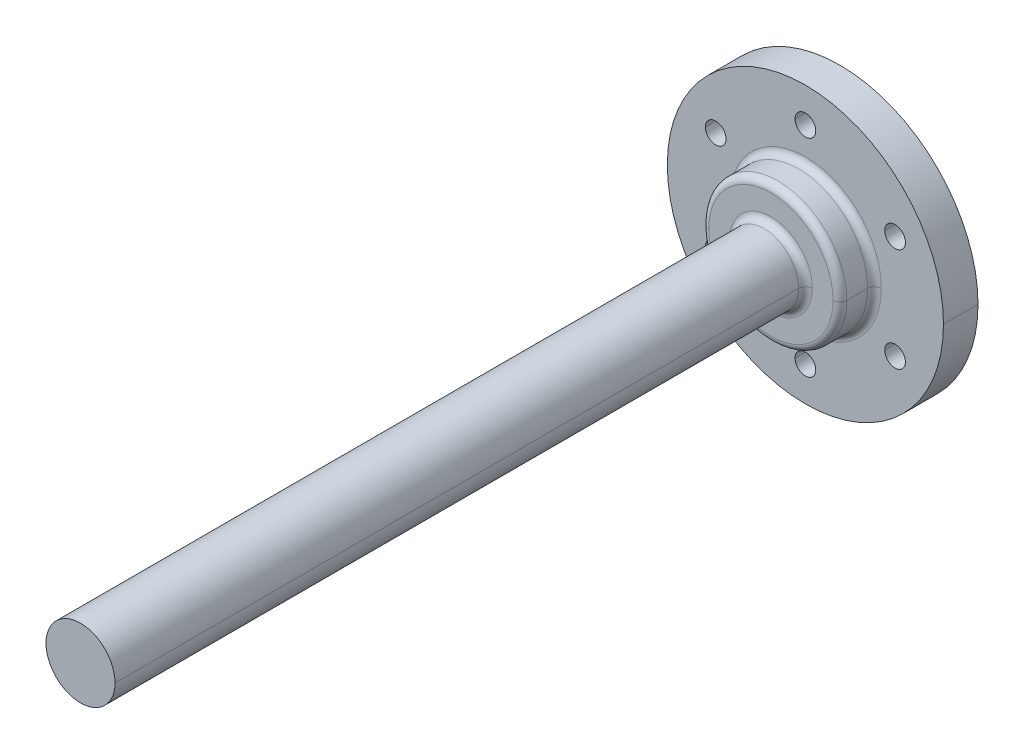
ISO-10303-21;
HEADER;
FILE_DESCRIPTION(('STEP AP214'),'2;1');
FILE_NAME('part.step','',(''),(''),'','','');
FILE_SCHEMA(('AUTOMOTIVE_DESIGN { 1 0 10303 214 1 1 1 1 }'));
ENDSEC;
DATA;
#1=APPLICATION_CONTEXT('core data for automotive mechanical design processes');
#2=APPLICATION_PROTOCOL_DEFINITION('international standard','automotive_design',2000,#1);
#3=PRODUCT_CONTEXT('',#1,'mechanical');
#4=PRODUCT('Part','Part','',(#3));
#5=PRODUCT_RELATED_PRODUCT_CATEGORY('part','',(#4));
#6=PRODUCT_DEFINITION_FORMATION('','',#4);
#7=PRODUCT_DEFINITION_CONTEXT('part definition',#1,'design');
#8=PRODUCT_DEFINITION('design','',#6,#7);
#9=PRODUCT_DEFINITION_SHAPE('','',#8);
#10=(LENGTH_UNIT() NAMED_UNIT(*) SI_UNIT(.MILLI.,.METRE.));
#11=(NAMED_UNIT(*) PLANE_ANGLE_UNIT() SI_UNIT($,.RADIAN.));
#12=(NAMED_UNIT(*) SI_UNIT($,.STERADIAN.) SOLID_ANGLE_UNIT());
#13=UNCERTAINTY_MEASURE_WITH_UNIT(LENGTH_MEASURE(1.E-05),#10,'distance_accuracy_value','');
#14=(GEOMETRIC_REPRESENTATION_CONTEXT(3) GLOBAL_UNCERTAINTY_ASSIGNED_CONTEXT((#13)) GLOBAL_UNIT_ASSIGNED_CONTEXT((#10,
#11,#12)) REPRESENTATION_CONTEXT('',''));
#15=CARTESIAN_POINT('',(0.,0.,0.));
#16=DIRECTION('',(0.,0.,1.));
#17=DIRECTION('',(1.,0.,0.));
#18=AXIS2_PLACEMENT_3D('',#15,#16,#17);
#19=CARTESIAN_POINT('',(0.,0.,11.));
#20=DIRECTION('',(0.,0.,1.));
#21=DIRECTION('',(1.,0.,0.));
#22=AXIS2_PLACEMENT_3D('',#19,#20,#21);
#23=TOROIDAL_SURFACE('',#22,6.,1.);
#24=CARTESIAN_POINT('',(-6.,0.,11.));
#25=DIRECTION('',(0.,1.,0.));
#26=DIRECTION('',(-1.,0.,0.));
#27=AXIS2_PLACEMENT_3D('',#24,#25,#26);
#28=CIRCLE('',#27,1.);
#29=CARTESIAN_POINT('',(-5.,0.,11.));
#30=VERTEX_POINT('',#29);
#31=CARTESIAN_POINT('',(-6.,0.,10.));
#32=VERTEX_POINT('',#31);
#33=EDGE_CURVE('E391',#30,#32,#28,.T.);
#34=ORIENTED_EDGE('',*,*,#33,.F.);
#35=CARTESIAN_POINT('',(0.,0.,11.));
#36=DIRECTION('',(0.,0.,1.));
#37=DIRECTION('',(1.,0.,0.));
#38=AXIS2_PLACEMENT_3D('',#35,#36,#37);
#39=CIRCLE('',#38,5.);
#40=CARTESIAN_POINT('',(5.,0.,11.));
#41=VERTEX_POINT('',#40);
#42=EDGE_CURVE('E269',#41,#30,#39,.T.);
#43=ORIENTED_EDGE('',*,*,#42,.F.);
#44=CARTESIAN_POINT('',(6.,0.,11.));
#45=DIRECTION('',(0.,-1.,0.));
#46=DIRECTION('',(0.,0.,-1.));
#47=AXIS2_PLACEMENT_3D('',#44,#45,#46);
#48=CIRCLE('',#47,1.);
#49=CARTESIAN_POINT('',(6.,0.,10.));
#50=VERTEX_POINT('',#49);
#51=EDGE_CURVE('E189',#41,#50,#48,.T.);
#52=ORIENTED_EDGE('',*,*,#51,.T.);
#53=CARTESIAN_POINT('',(0.,0.,10.));
#54=DIRECTION('',(0.,0.,-1.));
#55=DIRECTION('',(1.,0.,0.));
#56=AXIS2_PLACEMENT_3D('',#53,#54,#55);
#57=CIRCLE('',#56,6.);
#58=EDGE_CURVE('E28',#32,#50,#57,.T.);
#59=ORIENTED_EDGE('',*,*,#58,.F.);
#60=EDGE_LOOP('',(#34,#43,#52,#59));
#61=FACE_BOUND('',#60,.T.);
#62=ADVANCED_FACE('F17',(#61),#23,.F.);
#63=CARTESIAN_POINT('',(0.,0.,9.));
#64=DIRECTION('',(0.,0.,1.));
#65=DIRECTION('',(1.,0.,0.));
#66=AXIS2_PLACEMENT_3D('',#63,#64,#65);
#67=TOROIDAL_SURFACE('',#66,9.,1.);
#68=CARTESIAN_POINT('',(-9.,0.,9.));
#69=DIRECTION('',(0.,1.,0.));
#70=DIRECTION('',(-1.,0.,0.));
#71=AXIS2_PLACEMENT_3D('',#68,#69,#70);
#72=CIRCLE('',#71,1.);
#73=CARTESIAN_POINT('',(-10.,0.,9.));
#74=VERTEX_POINT('',#73);
#75=CARTESIAN_POINT('',(-9.,0.,10.));
#76=VERTEX_POINT('',#75);
#77=EDGE_CURVE('E255',#74,#76,#72,.T.);
#78=ORIENTED_EDGE('',*,*,#77,.F.);
#79=CARTESIAN_POINT('',(0.,0.,9.));
#80=DIRECTION('',(0.,0.,-1.));
#81=DIRECTION('',(1.,0.,0.));
#82=AXIS2_PLACEMENT_3D('',#79,#80,#81);
#83=CIRCLE('',#82,10.);
#84=CARTESIAN_POINT('',(10.,0.,9.));
#85=VERTEX_POINT('',#84);
#86=EDGE_CURVE('E290',#85,#74,#83,.T.);
#87=ORIENTED_EDGE('',*,*,#86,.F.);
#88=CARTESIAN_POINT('',(9.,0.,9.));
#89=DIRECTION('',(0.,-1.,0.));
#90=DIRECTION('',(0.,0.,-1.));
#91=AXIS2_PLACEMENT_3D('',#88,#89,#90);
#92=CIRCLE('',#91,1.);
#93=CARTESIAN_POINT('',(9.,0.,10.));
#94=VERTEX_POINT('',#93);
#95=EDGE_CURVE('E188',#85,#94,#92,.T.);
#96=ORIENTED_EDGE('',*,*,#95,.T.);
#97=CARTESIAN_POINT('',(0.,0.,10.));
#98=DIRECTION('',(0.,0.,1.));
#99=DIRECTION('',(1.,0.,0.));
#100=AXIS2_PLACEMENT_3D('',#97,#98,#99);
#101=CIRCLE('',#100,9.);
#102=EDGE_CURVE('E315',#76,#94,#101,.T.);
#103=ORIENTED_EDGE('',*,*,#102,.F.);
#104=EDGE_LOOP('',(#78,#87,#96,#103));
#105=FACE_BOUND('',#104,.T.);
#106=ADVANCED_FACE('F581',(#105),#67,.T.);
#107=CARTESIAN_POINT('',(0.,0.,6.));
#108=DIRECTION('',(0.,0.,1.));
#109=DIRECTION('',(1.,0.,0.));
#110=AXIS2_PLACEMENT_3D('',#107,#108,#109);
#111=TOROIDAL_SURFACE('',#110,11.,1.);
#112=CARTESIAN_POINT('',(-11.,0.,6.));
#113=DIRECTION('',(0.,1.,0.));
#114=DIRECTION('',(-1.,0.,0.));
#115=AXIS2_PLACEMENT_3D('',#112,#113,#114);
#116=CIRCLE('',#115,1.);
#117=CARTESIAN_POINT('',(-10.,0.,6.));
#118=VERTEX_POINT('',#117);
#119=CARTESIAN_POINT('',(-11.,0.,5.));
#120=VERTEX_POINT('',#119);
#121=EDGE_CURVE('E187',#118,#120,#116,.T.);
#122=ORIENTED_EDGE('',*,*,#121,.F.);
#123=CARTESIAN_POINT('',(0.,0.,6.));
#124=DIRECTION('',(0.,0.,1.));
#125=DIRECTION('',(1.,0.,0.));
#126=AXIS2_PLACEMENT_3D('',#123,#124,#125);
#127=CIRCLE('',#126,10.);
#128=CARTESIAN_POINT('',(10.,0.,6.));
#129=VERTEX_POINT('',#128);
#130=EDGE_CURVE('E352',#129,#118,#127,.T.);
#131=ORIENTED_EDGE('',*,*,#130,.F.);
#132=CARTESIAN_POINT('',(11.,0.,6.));
#133=DIRECTION('',(0.,-1.,0.));
#134=DIRECTION('',(0.,0.,-1.));
#135=AXIS2_PLACEMENT_3D('',#132,#133,#134);
#136=CIRCLE('',#135,1.);
#137=CARTESIAN_POINT('',(11.,0.,5.));
#138=VERTEX_POINT('',#137);
#139=EDGE_CURVE('E323',#129,#138,#136,.T.);
#140=ORIENTED_EDGE('',*,*,#139,.T.);
#141=CARTESIAN_POINT('',(0.,0.,5.));
#142=DIRECTION('',(0.,0.,-1.));
#143=DIRECTION('',(1.,0.,0.));
#144=AXIS2_PLACEMENT_3D('',#141,#142,#143);
#145=CIRCLE('',#144,11.);
#146=EDGE_CURVE('E210',#120,#138,#145,.T.);
#147=ORIENTED_EDGE('',*,*,#146,.F.);
#148=EDGE_LOOP('',(#122,#131,#140,#147));
#149=FACE_BOUND('',#148,.T.);
#150=ADVANCED_FACE('F587',(#149),#111,.F.);
#151=CARTESIAN_POINT('',(0.,0.,-4.));
#152=DIRECTION('',(0.,0.,1.));
#153=DIRECTION('',(1.,0.,0.));
#154=AXIS2_PLACEMENT_3D('',#151,#152,#153);
#155=TOROIDAL_SURFACE('',#154,4.,1.);
#156=CARTESIAN_POINT('',(-4.,0.,-4.));
#157=DIRECTION('',(0.,1.,0.));
#158=DIRECTION('',(-1.,0.,0.));
#159=AXIS2_PLACEMENT_3D('',#156,#157,#158);
#160=CIRCLE('',#159,1.);
#161=CARTESIAN_POINT('',(-4.,0.,-5.));
#162=VERTEX_POINT('',#161);
#163=CARTESIAN_POINT('',(-5.,0.,-4.));
#164=VERTEX_POINT('',#163);
#165=EDGE_CURVE('E199',#162,#164,#160,.T.);
#166=ORIENTED_EDGE('',*,*,#165,.F.);
#167=CARTESIAN_POINT('',(0.,0.,-5.));
#168=DIRECTION('',(0.,0.,-1.));
#169=DIRECTION('',(1.,0.,0.));
#170=AXIS2_PLACEMENT_3D('',#167,#168,#169);
#171=CIRCLE('',#170,4.);
#172=CARTESIAN_POINT('',(4.,0.,-5.));
#173=VERTEX_POINT('',#172);
#174=EDGE_CURVE('E209',#173,#162,#171,.T.);
#175=ORIENTED_EDGE('',*,*,#174,.F.);
#176=CARTESIAN_POINT('',(4.,0.,-4.));
#177=DIRECTION('',(0.,-1.,0.));
#178=DIRECTION('',(0.,0.,-1.));
#179=AXIS2_PLACEMENT_3D('',#176,#177,#178);
#180=CIRCLE('',#179,1.);
#181=CARTESIAN_POINT('',(5.,0.,-4.));
#182=VERTEX_POINT('',#181);
#183=EDGE_CURVE('E214',#173,#182,#180,.T.);
#184=ORIENTED_EDGE('',*,*,#183,.T.);
#185=CARTESIAN_POINT('',(0.,0.,-4.));
#186=DIRECTION('',(0.,0.,1.));
#187=DIRECTION('',(1.,0.,0.));
#188=AXIS2_PLACEMENT_3D('',#185,#186,#187);
#189=CIRCLE('',#188,5.);
#190=EDGE_CURVE('E205',#164,#182,#189,.T.);
#191=ORIENTED_EDGE('',*,*,#190,.F.);
#192=EDGE_LOOP('',(#166,#175,#184,#191));
#193=FACE_BOUND('',#192,.T.);
#194=ADVANCED_FACE('F635',(#193),#155,.T.);
#195=CARTESIAN_POINT('',(0.,0.,110.));
#196=DIRECTION('',(0.,0.,-1.));
#197=DIRECTION('',(-1.,0.,0.));
#198=AXIS2_PLACEMENT_3D('',#195,#196,#197);
#199=CYLINDRICAL_SURFACE('',#198,5.);
#200=DIRECTION('',(0.,0.,-1.));
#201=VECTOR('',#200,1.);
#202=CARTESIAN_POINT('',(5.,0.,110.));
#203=LINE('',#202,#201);
#204=CARTESIAN_POINT('',(5.,0.,110.));
#205=VERTEX_POINT('',#204);
#206=EDGE_CURVE('E348',#205,#41,#203,.T.);
#207=ORIENTED_EDGE('',*,*,#206,.F.);
#208=CARTESIAN_POINT('',(0.,0.,110.));
#209=DIRECTION('',(0.,0.,1.));
#210=DIRECTION('',(1.,0.,0.));
#211=AXIS2_PLACEMENT_3D('',#208,#209,#210);
#212=CIRCLE('',#211,5.);
#213=CARTESIAN_POINT('',(-5.,0.,110.));
#214=VERTEX_POINT('',#213);
#215=EDGE_CURVE('E11',#214,#205,#212,.T.);
#216=ORIENTED_EDGE('',*,*,#215,.F.);
#217=DIRECTION('',(0.,0.,-1.));
#218=VECTOR('',#217,1.);
#219=CARTESIAN_POINT('',(-5.,0.,110.));
#220=LINE('',#219,#218);
#221=EDGE_CURVE('E264',#214,#30,#220,.T.);
#222=ORIENTED_EDGE('',*,*,#221,.T.);
#223=CARTESIAN_POINT('',(0.,0.,11.));
#224=DIRECTION('',(0.,0.,1.));
#225=DIRECTION('',(1.,0.,0.));
#226=AXIS2_PLACEMENT_3D('',#223,#224,#225);
#227=CIRCLE('',#226,5.);
#228=EDGE_CURVE('E407',#30,#41,#227,.T.);
#229=ORIENTED_EDGE('',*,*,#228,.T.);
#230=EDGE_LOOP('',(#207,#216,#222,#229));
#231=FACE_BOUND('',#230,.T.);
#232=ADVANCED_FACE('F653',(#231),#199,.T.);
#233=CARTESIAN_POINT('',(0.,0.,110.));
#234=DIRECTION('',(0.,0.,1.));
#235=DIRECTION('',(1.,0.,0.));
#236=AXIS2_PLACEMENT_3D('',#233,#234,#235);
#237=PLANE('',#236);
#238=ORIENTED_EDGE('',*,*,#215,.T.);
#239=CARTESIAN_POINT('',(0.,0.,110.));
#240=DIRECTION('',(0.,0.,1.));
#241=DIRECTION('',(1.,0.,0.));
#242=AXIS2_PLACEMENT_3D('',#239,#240,#241);
#243=CIRCLE('',#242,5.);
#244=EDGE_CURVE('E378',#205,#214,#243,.T.);
#245=ORIENTED_EDGE('',*,*,#244,.T.);
#246=EDGE_LOOP('',(#238,#245));
#247=FACE_BOUND('',#246,.T.);
#248=ADVANCED_FACE('F660',(#247),#237,.T.);
#249=CARTESIAN_POINT('',(0.,0.,10.));
#250=DIRECTION('',(0.,0.,1.));
#251=DIRECTION('',(1.,0.,0.));
#252=AXIS2_PLACEMENT_3D('',#249,#250,#251);
#253=PLANE('',#252);
#254=CARTESIAN_POINT('',(0.,0.,10.));
#255=DIRECTION('',(0.,0.,-1.));
#256=DIRECTION('',(1.,0.,0.));
#257=AXIS2_PLACEMENT_3D('',#254,#255,#256);
#258=CIRCLE('',#257,6.);
#259=EDGE_CURVE('E194',#50,#32,#258,.T.);
#260=ORIENTED_EDGE('',*,*,#259,.T.);
#261=ORIENTED_EDGE('',*,*,#58,.T.);
#262=EDGE_LOOP('',(#260,#261));
#263=FACE_BOUND('',#262,.T.);
#264=CARTESIAN_POINT('',(0.,0.,10.));
#265=DIRECTION('',(0.,0.,1.));
#266=DIRECTION('',(1.,0.,0.));
#267=AXIS2_PLACEMENT_3D('',#264,#265,#266);
#268=CIRCLE('',#267,9.);
#269=EDGE_CURVE('E319',#94,#76,#268,.T.);
#270=ORIENTED_EDGE('',*,*,#269,.T.);
#271=ORIENTED_EDGE('',*,*,#102,.T.);
#272=EDGE_LOOP('',(#270,#271));
#273=FACE_BOUND('',#272,.T.);
#274=ADVANCED_FACE('F592',(#263,#273),#253,.T.);
#275=CARTESIAN_POINT('',(0.,0.,10.));
#276=DIRECTION('',(0.,0.,-1.));
#277=DIRECTION('',(-1.,0.,0.));
#278=AXIS2_PLACEMENT_3D('',#275,#276,#277);
#279=CYLINDRICAL_SURFACE('',#278,10.);
#280=DIRECTION('',(0.,0.,-1.));
#281=VECTOR('',#280,1.);
#282=CARTESIAN_POINT('',(10.,0.,10.));
#283=LINE('',#282,#281);
#284=EDGE_CURVE('E268',#85,#129,#283,.T.);
#285=ORIENTED_EDGE('',*,*,#284,.F.);
#286=ORIENTED_EDGE('',*,*,#86,.T.);
#287=DIRECTION('',(0.,0.,-1.));
#288=VECTOR('',#287,1.);
#289=CARTESIAN_POINT('',(-10.,0.,10.));
#290=LINE('',#289,#288);
#291=EDGE_CURVE('E244',#74,#118,#290,.T.);
#292=ORIENTED_EDGE('',*,*,#291,.T.);
#293=CARTESIAN_POINT('',(0.,0.,6.));
#294=DIRECTION('',(0.,0.,1.));
#295=DIRECTION('',(1.,0.,0.));
#296=AXIS2_PLACEMENT_3D('',#293,#294,#295);
#297=CIRCLE('',#296,10.);
#298=EDGE_CURVE('E183',#118,#129,#297,.T.);
#299=ORIENTED_EDGE('',*,*,#298,.T.);
#300=EDGE_LOOP('',(#285,#286,#292,#299));
#301=FACE_BOUND('',#300,.T.);
#302=ADVANCED_FACE('F637',(#301),#279,.T.);
#303=CARTESIAN_POINT('',(0.,0.,-5.));
#304=DIRECTION('',(0.,0.,1.));
#305=DIRECTION('',(1.,0.,0.));
#306=AXIS2_PLACEMENT_3D('',#303,#304,#305);
#307=PLANE('',#306);
#308=ORIENTED_EDGE('',*,*,#174,.T.);
#309=CARTESIAN_POINT('',(0.,0.,-5.));
#310=DIRECTION('',(0.,0.,-1.));
#311=DIRECTION('',(1.,0.,0.));
#312=AXIS2_PLACEMENT_3D('',#309,#310,#311);
#313=CIRCLE('',#312,4.);
#314=EDGE_CURVE('E204',#162,#173,#313,.T.);
#315=ORIENTED_EDGE('',*,*,#314,.T.);
#316=EDGE_LOOP('',(#308,#315));
#317=FACE_BOUND('',#316,.T.);
#318=ADVANCED_FACE('F575',(#317),#307,.F.);
#319=CARTESIAN_POINT('',(0.,0.,110.));
#320=DIRECTION('',(0.,0.,-1.));
#321=DIRECTION('',(-1.,0.,0.));
#322=AXIS2_PLACEMENT_3D('',#319,#320,#321);
#323=CYLINDRICAL_SURFACE('',#322,5.);
#324=DIRECTION('',(0.,0.,-1.));
#325=VECTOR('',#324,1.);
#326=CARTESIAN_POINT('',(5.,0.,110.));
#327=LINE('',#326,#325);
#328=CARTESIAN_POINT('',(5.,0.,0.));
#329=VERTEX_POINT('',#328);
#330=EDGE_CURVE('E270',#329,#182,#327,.T.);
#331=ORIENTED_EDGE('',*,*,#330,.F.);
#332=CARTESIAN_POINT('',(0.,0.,0.));
#333=DIRECTION('',(0.,0.,-1.));
#334=DIRECTION('',(1.,0.,0.));
#335=AXIS2_PLACEMENT_3D('',#332,#333,#334);
#336=CIRCLE('',#335,5.);
#337=CARTESIAN_POINT('',(-5.,0.,0.));
#338=VERTEX_POINT('',#337);
#339=EDGE_CURVE('E260',#329,#338,#336,.T.);
#340=ORIENTED_EDGE('',*,*,#339,.T.);
#341=DIRECTION('',(0.,0.,-1.));
#342=VECTOR('',#341,1.);
#343=CARTESIAN_POINT('',(-5.,0.,110.));
#344=LINE('',#343,#342);
#345=EDGE_CURVE('E274',#338,#164,#344,.T.);
#346=ORIENTED_EDGE('',*,*,#345,.T.);
#347=ORIENTED_EDGE('',*,*,#190,.T.);
#348=EDGE_LOOP('',(#331,#340,#346,#347));
#349=FACE_BOUND('',#348,.T.);
#350=ADVANCED_FACE('F568',(#349),#323,.T.);
#351=CARTESIAN_POINT('',(0.,0.,5.));
#352=DIRECTION('',(0.,0.,1.));
#353=DIRECTION('',(1.,0.,0.));
#354=AXIS2_PLACEMENT_3D('',#351,#352,#353);
#355=PLANE('',#354);
#356=CARTESIAN_POINT('',(0.,15.,5.));
#357=DIRECTION('',(0.,0.,1.));
#358=DIRECTION('',(1.,0.,0.));
#359=AXIS2_PLACEMENT_3D('',#356,#357,#358);
#360=CIRCLE('',#359,1.5);
#361=CARTESIAN_POINT('',(-1.5,15.,5.));
#362=VERTEX_POINT('',#361);
#363=CARTESIAN_POINT('',(1.5,15.,5.));
#364=VERTEX_POINT('',#363);
#365=EDGE_CURVE('E142',#362,#364,#360,.T.);
#366=ORIENTED_EDGE('',*,*,#365,.F.);
#367=CARTESIAN_POINT('',(0.,15.,5.));
#368=DIRECTION('',(0.,0.,1.));
#369=DIRECTION('',(1.,0.,0.));
#370=AXIS2_PLACEMENT_3D('',#367,#368,#369);
#371=CIRCLE('',#370,1.5);
#372=EDGE_CURVE('E137',#364,#362,#371,.T.);
#373=ORIENTED_EDGE('',*,*,#372,.F.);
#374=EDGE_LOOP('',(#366,#373));
#375=FACE_BOUND('',#374,.T.);
#376=CARTESIAN_POINT('',(12.9903810567669,7.50000000000056,5.));
#377=DIRECTION('',(0.,0.,1.));
#378=DIRECTION('',(1.,0.,0.));
#379=AXIS2_PLACEMENT_3D('',#376,#377,#378);
#380=CIRCLE('',#379,1.50000000000018);
#381=CARTESIAN_POINT('',(11.4903810567667,7.50000000000056,5.));
#382=VERTEX_POINT('',#381);
#383=CARTESIAN_POINT('',(14.4903810567671,7.50000000000056,5.));
#384=VERTEX_POINT('',#383);
#385=EDGE_CURVE('E311',#382,#384,#380,.T.);
#386=ORIENTED_EDGE('',*,*,#385,.F.);
#387=CARTESIAN_POINT('',(12.9903810567669,7.50000000000056,5.));
#388=DIRECTION('',(0.,0.,1.));
#389=DIRECTION('',(1.,0.,0.));
#390=AXIS2_PLACEMENT_3D('',#387,#388,#389);
#391=CIRCLE('',#390,1.50000000000018);
#392=EDGE_CURVE('E179',#384,#382,#391,.T.);
#393=ORIENTED_EDGE('',*,*,#392,.F.);
#394=EDGE_LOOP('',(#386,#393));
#395=FACE_BOUND('',#394,.T.);
#396=CARTESIAN_POINT('',(12.9903810567675,-7.49999999999945,5.));
#397=DIRECTION('',(0.,0.,1.));
#398=DIRECTION('',(1.,0.,0.));
#399=AXIS2_PLACEMENT_3D('',#396,#397,#398);
#400=CIRCLE('',#399,1.50000000000083);
#401=CARTESIAN_POINT('',(11.4903810567667,-7.49999999999945,5.));
#402=VERTEX_POINT('',#401);
#403=CARTESIAN_POINT('',(14.4903810567684,-7.49999999999945,5.));
#404=VERTEX_POINT('',#403);
#405=EDGE_CURVE('E287',#402,#404,#400,.T.);
#406=ORIENTED_EDGE('',*,*,#405,.F.);
#407=CARTESIAN_POINT('',(12.9903810567675,-7.49999999999945,5.));
#408=DIRECTION('',(0.,0.,1.));
#409=DIRECTION('',(1.,0.,0.));
#410=AXIS2_PLACEMENT_3D('',#407,#408,#409);
#411=CIRCLE('',#410,1.50000000000083);
#412=EDGE_CURVE('E178',#404,#402,#411,.T.);
#413=ORIENTED_EDGE('',*,*,#412,.F.);
#414=EDGE_LOOP('',(#406,#413));
#415=FACE_BOUND('',#414,.T.);
#416=CARTESIAN_POINT('',(1.27346601377202E-12,-15.,5.));
#417=DIRECTION('',(0.,0.,1.));
#418=DIRECTION('',(1.,0.,0.));
#419=AXIS2_PLACEMENT_3D('',#416,#417,#418);
#420=CIRCLE('',#419,1.50000000000132);
#421=CARTESIAN_POINT('',(-1.50000000000005,-15.,5.));
#422=VERTEX_POINT('',#421);
#423=CARTESIAN_POINT('',(1.50000000000259,-15.,5.));
#424=VERTEX_POINT('',#423);
#425=EDGE_CURVE('E281',#422,#424,#420,.T.);
#426=ORIENTED_EDGE('',*,*,#425,.F.);
#427=CARTESIAN_POINT('',(1.27346601377202E-12,-15.,5.));
#428=DIRECTION('',(0.,0.,1.));
#429=DIRECTION('',(1.,0.,0.));
#430=AXIS2_PLACEMENT_3D('',#427,#428,#429);
#431=CIRCLE('',#430,1.50000000000132);
#432=EDGE_CURVE('E291',#424,#422,#431,.T.);
#433=ORIENTED_EDGE('',*,*,#432,.F.);
#434=EDGE_LOOP('',(#426,#433));
#435=FACE_BOUND('',#434,.T.);
#436=CARTESIAN_POINT('',(-12.9903810567656,-7.50000000000056,5.));
#437=DIRECTION('',(0.,0.,1.));
#438=DIRECTION('',(1.,0.,0.));
#439=AXIS2_PLACEMENT_3D('',#436,#437,#438);
#440=CIRCLE('',#439,1.50000000000122);
#441=CARTESIAN_POINT('',(-14.4903810567668,-7.50000000000056,5.));
#442=VERTEX_POINT('',#441);
#443=CARTESIAN_POINT('',(-11.4903810567644,-7.50000000000056,5.));
#444=VERTEX_POINT('',#443);
#445=EDGE_CURVE('E306',#442,#444,#440,.T.);
#446=ORIENTED_EDGE('',*,*,#445,.F.);
#447=CARTESIAN_POINT('',(-12.9903810567656,-7.50000000000056,5.));
#448=DIRECTION('',(0.,0.,1.));
#449=DIRECTION('',(1.,0.,0.));
#450=AXIS2_PLACEMENT_3D('',#447,#448,#449);
#451=CIRCLE('',#450,1.50000000000122);
#452=EDGE_CURVE('E219',#444,#442,#451,.T.);
#453=ORIENTED_EDGE('',*,*,#452,.F.);
#454=EDGE_LOOP('',(#446,#453));
#455=FACE_BOUND('',#454,.T.);
#456=CARTESIAN_POINT('',(-12.9903810567663,7.49999999999944,5.));
#457=DIRECTION('',(0.,0.,1.));
#458=DIRECTION('',(1.,0.,0.));
#459=AXIS2_PLACEMENT_3D('',#456,#457,#458);
#460=CIRCLE('',#459,1.50000000000065);
#461=CARTESIAN_POINT('',(-14.4903810567669,7.49999999999944,5.));
#462=VERTEX_POINT('',#461);
#463=CARTESIAN_POINT('',(-11.4903810567656,7.49999999999944,5.));
#464=VERTEX_POINT('',#463);
#465=EDGE_CURVE('E368',#462,#464,#460,.T.);
#466=ORIENTED_EDGE('',*,*,#465,.F.);
#467=CARTESIAN_POINT('',(-12.9903810567663,7.49999999999944,5.));
#468=DIRECTION('',(0.,0.,1.));
#469=DIRECTION('',(1.,0.,0.));
#470=AXIS2_PLACEMENT_3D('',#467,#468,#469);
#471=CIRCLE('',#470,1.50000000000065);
#472=EDGE_CURVE('E218',#464,#462,#471,.T.);
#473=ORIENTED_EDGE('',*,*,#472,.F.);
#474=EDGE_LOOP('',(#466,#473));
#475=FACE_BOUND('',#474,.T.);
#476=CARTESIAN_POINT('',(0.,0.,5.));
#477=DIRECTION('',(0.,0.,-1.));
#478=DIRECTION('',(1.,0.,0.));
#479=AXIS2_PLACEMENT_3D('',#476,#477,#478);
#480=CIRCLE('',#479,11.);
#481=EDGE_CURVE('E198',#138,#120,#480,.T.);
#482=ORIENTED_EDGE('',*,*,#481,.T.);
#483=ORIENTED_EDGE('',*,*,#146,.T.);
#484=EDGE_LOOP('',(#482,#483));
#485=FACE_BOUND('',#484,.T.);
#486=CARTESIAN_POINT('',(0.,0.,5.));
#487=DIRECTION('',(0.,0.,1.));
#488=DIRECTION('',(1.,0.,0.));
#489=AXIS2_PLACEMENT_3D('',#486,#487,#488);
#490=CIRCLE('',#489,20.);
#491=CARTESIAN_POINT('',(-20.,0.,5.));
#492=VERTEX_POINT('',#491);
#493=CARTESIAN_POINT('',(20.,0.,5.));
#494=VERTEX_POINT('',#493);
#495=EDGE_CURVE('E232',#492,#494,#490,.T.);
#496=ORIENTED_EDGE('',*,*,#495,.T.);
#497=CARTESIAN_POINT('',(0.,0.,5.));
#498=DIRECTION('',(0.,0.,1.));
#499=DIRECTION('',(1.,0.,0.));
#500=AXIS2_PLACEMENT_3D('',#497,#498,#499);
#501=CIRCLE('',#500,20.);
#502=EDGE_CURVE('E182',#494,#492,#501,.T.);
#503=ORIENTED_EDGE('',*,*,#502,.T.);
#504=EDGE_LOOP('',(#496,#503));
#505=FACE_BOUND('',#504,.T.);
#506=ADVANCED_FACE('F139',(#375,#395,#415,#435,#455,#475,#485,#505),#355,.T.);
#507=CARTESIAN_POINT('',(0.,0.,0.));
#508=DIRECTION('',(0.,0.,1.));
#509=DIRECTION('',(1.,0.,0.));
#510=AXIS2_PLACEMENT_3D('',#507,#508,#509);
#511=PLANE('',#510);
#512=CARTESIAN_POINT('',(0.,0.,0.));
#513=DIRECTION('',(0.,0.,-1.));
#514=DIRECTION('',(1.,0.,0.));
#515=AXIS2_PLACEMENT_3D('',#512,#513,#514);
#516=CIRCLE('',#515,5.);
#517=EDGE_CURVE('E275',#338,#329,#516,.T.);
#518=ORIENTED_EDGE('',*,*,#517,.F.);
#519=ORIENTED_EDGE('',*,*,#339,.F.);
#520=EDGE_LOOP('',(#518,#519));
#521=FACE_BOUND('',#520,.T.);
#522=CARTESIAN_POINT('',(0.,15.,0.));
#523=DIRECTION('',(0.,0.,1.));
#524=DIRECTION('',(1.,0.,0.));
#525=AXIS2_PLACEMENT_3D('',#522,#523,#524);
#526=CIRCLE('',#525,1.5);
#527=CARTESIAN_POINT('',(-1.5,15.,0.));
#528=VERTEX_POINT('',#527);
#529=CARTESIAN_POINT('',(1.5,15.,0.));
#530=VERTEX_POINT('',#529);
#531=EDGE_CURVE('E157',#528,#530,#526,.T.);
#532=ORIENTED_EDGE('',*,*,#531,.T.);
#533=CARTESIAN_POINT('',(0.,15.,0.));
#534=DIRECTION('',(0.,0.,1.));
#535=DIRECTION('',(1.,0.,0.));
#536=AXIS2_PLACEMENT_3D('',#533,#534,#535);
#537=CIRCLE('',#536,1.5);
#538=EDGE_CURVE('E147',#530,#528,#537,.T.);
#539=ORIENTED_EDGE('',*,*,#538,.T.);
#540=EDGE_LOOP('',(#532,#539));
#541=FACE_BOUND('',#540,.T.);
#542=CARTESIAN_POINT('',(12.9903810567669,7.50000000000056,0.));
#543=DIRECTION('',(0.,0.,1.));
#544=DIRECTION('',(1.,0.,0.));
#545=AXIS2_PLACEMENT_3D('',#542,#543,#544);
#546=CIRCLE('',#545,1.50000000000018);
#547=CARTESIAN_POINT('',(11.4903810567667,7.50000000000056,0.));
#548=VERTEX_POINT('',#547);
#549=CARTESIAN_POINT('',(14.4903810567671,7.50000000000056,0.));
#550=VERTEX_POINT('',#549);
#551=EDGE_CURVE('E169',#548,#550,#546,.T.);
#552=ORIENTED_EDGE('',*,*,#551,.T.);
#553=CARTESIAN_POINT('',(12.9903810567669,7.50000000000056,0.));
#554=DIRECTION('',(0.,0.,1.));
#555=DIRECTION('',(1.,0.,0.));
#556=AXIS2_PLACEMENT_3D('',#553,#554,#555);
#557=CIRCLE('',#556,1.50000000000018);
#558=EDGE_CURVE('E174',#550,#548,#557,.T.);
#559=ORIENTED_EDGE('',*,*,#558,.T.);
#560=EDGE_LOOP('',(#552,#559));
#561=FACE_BOUND('',#560,.T.);
#562=CARTESIAN_POINT('',(12.9903810567675,-7.49999999999945,0.));
#563=DIRECTION('',(0.,0.,1.));
#564=DIRECTION('',(1.,0.,0.));
#565=AXIS2_PLACEMENT_3D('',#562,#563,#564);
#566=CIRCLE('',#565,1.50000000000083);
#567=CARTESIAN_POINT('',(11.4903810567667,-7.49999999999945,0.));
#568=VERTEX_POINT('',#567);
#569=CARTESIAN_POINT('',(14.4903810567684,-7.49999999999945,0.));
#570=VERTEX_POINT('',#569);
#571=EDGE_CURVE('E286',#568,#570,#566,.T.);
#572=ORIENTED_EDGE('',*,*,#571,.T.);
#573=CARTESIAN_POINT('',(12.9903810567675,-7.49999999999945,0.));
#574=DIRECTION('',(0.,0.,1.));
#575=DIRECTION('',(1.,0.,0.));
#576=AXIS2_PLACEMENT_3D('',#573,#574,#575);
#577=CIRCLE('',#576,1.50000000000083);
#578=EDGE_CURVE('E294',#570,#568,#577,.T.);
#579=ORIENTED_EDGE('',*,*,#578,.T.);
#580=EDGE_LOOP('',(#572,#579));
#581=FACE_BOUND('',#580,.T.);
#582=CARTESIAN_POINT('',(1.27346601377202E-12,-15.,0.));
#583=DIRECTION('',(0.,0.,1.));
#584=DIRECTION('',(1.,0.,0.));
#585=AXIS2_PLACEMENT_3D('',#582,#583,#584);
#586=CIRCLE('',#585,1.50000000000132);
#587=CARTESIAN_POINT('',(-1.50000000000005,-15.,0.));
#588=VERTEX_POINT('',#587);
#589=CARTESIAN_POINT('',(1.50000000000259,-15.,0.));
#590=VERTEX_POINT('',#589);
#591=EDGE_CURVE('E280',#588,#590,#586,.T.);
#592=ORIENTED_EDGE('',*,*,#591,.T.);
#593=CARTESIAN_POINT('',(1.27346601377202E-12,-15.,0.));
#594=DIRECTION('',(0.,0.,1.));
#595=DIRECTION('',(1.,0.,0.));
#596=AXIS2_PLACEMENT_3D('',#593,#594,#595);
#597=CIRCLE('',#596,1.50000000000132);
#598=EDGE_CURVE('E258',#590,#588,#597,.T.);
#599=ORIENTED_EDGE('',*,*,#598,.T.);
#600=EDGE_LOOP('',(#592,#599));
#601=FACE_BOUND('',#600,.T.);
#602=CARTESIAN_POINT('',(-12.9903810567656,-7.50000000000056,0.));
#603=DIRECTION('',(0.,0.,1.));
#604=DIRECTION('',(1.,0.,0.));
#605=AXIS2_PLACEMENT_3D('',#602,#603,#604);
#606=CIRCLE('',#605,1.50000000000122);
#607=CARTESIAN_POINT('',(-14.4903810567668,-7.50000000000056,0.));
#608=VERTEX_POINT('',#607);
#609=CARTESIAN_POINT('',(-11.4903810567644,-7.50000000000056,0.));
#610=VERTEX_POINT('',#609);
#611=EDGE_CURVE('E246',#608,#610,#606,.T.);
#612=ORIENTED_EDGE('',*,*,#611,.T.);
#613=CARTESIAN_POINT('',(-12.9903810567656,-7.50000000000056,0.));
#614=DIRECTION('',(0.,0.,1.));
#615=DIRECTION('',(1.,0.,0.));
#616=AXIS2_PLACEMENT_3D('',#613,#614,#615);
#617=CIRCLE('',#616,1.50000000000122);
#618=EDGE_CURVE('E215',#610,#608,#617,.T.);
#619=ORIENTED_EDGE('',*,*,#618,.T.);
#620=EDGE_LOOP('',(#612,#619));
#621=FACE_BOUND('',#620,.T.);
#622=CARTESIAN_POINT('',(-12.9903810567663,7.49999999999944,0.));
#623=DIRECTION('',(0.,0.,1.));
#624=DIRECTION('',(1.,0.,0.));
#625=AXIS2_PLACEMENT_3D('',#622,#623,#624);
#626=CIRCLE('',#625,1.50000000000065);
#627=CARTESIAN_POINT('',(-14.4903810567669,7.49999999999944,0.));
#628=VERTEX_POINT('',#627);
#629=CARTESIAN_POINT('',(-11.4903810567656,7.49999999999944,0.));
#630=VERTEX_POINT('',#629);
#631=EDGE_CURVE('E355',#628,#630,#626,.T.);
#632=ORIENTED_EDGE('',*,*,#631,.T.);
#633=CARTESIAN_POINT('',(-12.9903810567663,7.49999999999944,0.));
#634=DIRECTION('',(0.,0.,1.));
#635=DIRECTION('',(1.,0.,0.));
#636=AXIS2_PLACEMENT_3D('',#633,#634,#635);
#637=CIRCLE('',#636,1.50000000000065);
#638=EDGE_CURVE('E263',#630,#628,#637,.T.);
#639=ORIENTED_EDGE('',*,*,#638,.T.);
#640=EDGE_LOOP('',(#632,#639));
#641=FACE_BOUND('',#640,.T.);
#642=CARTESIAN_POINT('',(0.,0.,0.));
#643=DIRECTION('',(0.,0.,1.));
#644=DIRECTION('',(1.,0.,0.));
#645=AXIS2_PLACEMENT_3D('',#642,#643,#644);
#646=CIRCLE('',#645,20.);
#647=CARTESIAN_POINT('',(-20.,0.,0.));
#648=VERTEX_POINT('',#647);
#649=CARTESIAN_POINT('',(20.,0.,0.));
#650=VERTEX_POINT('',#649);
#651=EDGE_CURVE('E42',#648,#650,#646,.T.);
#652=ORIENTED_EDGE('',*,*,#651,.F.);
#653=CARTESIAN_POINT('',(0.,0.,0.));
#654=DIRECTION('',(0.,0.,1.));
#655=DIRECTION('',(1.,0.,0.));
#656=AXIS2_PLACEMENT_3D('',#653,#654,#655);
#657=CIRCLE('',#656,20.);
#658=EDGE_CURVE('E220',#650,#648,#657,.T.);
#659=ORIENTED_EDGE('',*,*,#658,.F.);
#660=EDGE_LOOP('',(#652,#659));
#661=FACE_BOUND('',#660,.T.);
#662=ADVANCED_FACE('F551',(#521,#541,#561,#581,#601,#621,#641,#661),#511,.F.);
#663=CARTESIAN_POINT('',(-12.9903810567663,7.49999999999944,5.));
#664=DIRECTION('',(0.,0.,-1.));
#665=DIRECTION('',(-1.,0.,0.));
#666=AXIS2_PLACEMENT_3D('',#663,#664,#665);
#667=CYLINDRICAL_SURFACE('',#666,1.50000000000065);
#668=DIRECTION('',(0.,0.,-1.));
#669=VECTOR('',#668,1.);
#670=CARTESIAN_POINT('',(-11.4903810567656,7.49999999999944,5.));
#671=LINE('',#670,#669);
#672=EDGE_CURVE('E359',#464,#630,#671,.T.);
#673=ORIENTED_EDGE('',*,*,#672,.F.);
#674=ORIENTED_EDGE('',*,*,#472,.T.);
#675=DIRECTION('',(0.,0.,-1.));
#676=VECTOR('',#675,1.);
#677=CARTESIAN_POINT('',(-14.4903810567669,7.49999999999944,5.));
#678=LINE('',#677,#676);
#679=EDGE_CURVE('E21',#462,#628,#678,.T.);
#680=ORIENTED_EDGE('',*,*,#679,.T.);
#681=ORIENTED_EDGE('',*,*,#638,.F.);
#682=EDGE_LOOP('',(#673,#674,#680,#681));
#683=FACE_BOUND('',#682,.T.);
#684=ADVANCED_FACE('F523',(#683),#667,.F.);
#685=CARTESIAN_POINT('',(-12.9903810567656,-7.50000000000056,5.));
#686=DIRECTION('',(0.,0.,-1.));
#687=DIRECTION('',(-1.,0.,0.));
#688=AXIS2_PLACEMENT_3D('',#685,#686,#687);
#689=CYLINDRICAL_SURFACE('',#688,1.50000000000122);
#690=DIRECTION('',(0.,0.,-1.));
#691=VECTOR('',#690,1.);
#692=CARTESIAN_POINT('',(-11.4903810567644,-7.50000000000056,5.));
#693=LINE('',#692,#691);
#694=EDGE_CURVE('E251',#444,#610,#693,.T.);
#695=ORIENTED_EDGE('',*,*,#694,.F.);
#696=ORIENTED_EDGE('',*,*,#452,.T.);
#697=DIRECTION('',(0.,0.,-1.));
#698=VECTOR('',#697,1.);
#699=CARTESIAN_POINT('',(-14.4903810567668,-7.50000000000056,5.));
#700=LINE('',#699,#698);
#701=EDGE_CURVE('E250',#442,#608,#700,.T.);
#702=ORIENTED_EDGE('',*,*,#701,.T.);
#703=ORIENTED_EDGE('',*,*,#618,.F.);
#704=EDGE_LOOP('',(#695,#696,#702,#703));
#705=FACE_BOUND('',#704,.T.);
#706=ADVANCED_FACE('F19',(#705),#689,.F.);
#707=CARTESIAN_POINT('',(1.27346601377202E-12,-15.,5.));
#708=DIRECTION('',(0.,0.,-1.));
#709=DIRECTION('',(-1.,0.,0.));
#710=AXIS2_PLACEMENT_3D('',#707,#708,#709);
#711=CYLINDRICAL_SURFACE('',#710,1.50000000000132);
#712=DIRECTION('',(0.,0.,-1.));
#713=VECTOR('',#712,1.);
#714=CARTESIAN_POINT('',(1.50000000000259,-15.,5.));
#715=LINE('',#714,#713);
#716=EDGE_CURVE('E276',#424,#590,#715,.T.);
#717=ORIENTED_EDGE('',*,*,#716,.F.);
#718=ORIENTED_EDGE('',*,*,#432,.T.);
#719=DIRECTION('',(0.,0.,-1.));
#720=VECTOR('',#719,1.);
#721=CARTESIAN_POINT('',(-1.50000000000005,-15.,5.));
#722=LINE('',#721,#720);
#723=EDGE_CURVE('E341',#422,#588,#722,.T.);
#724=ORIENTED_EDGE('',*,*,#723,.T.);
#725=ORIENTED_EDGE('',*,*,#598,.F.);
#726=EDGE_LOOP('',(#717,#718,#724,#725));
#727=FACE_BOUND('',#726,.T.);
#728=ADVANCED_FACE('F631',(#727),#711,.F.);
#729=CARTESIAN_POINT('',(12.9903810567675,-7.49999999999945,5.));
#730=DIRECTION('',(0.,0.,-1.));
#731=DIRECTION('',(-1.,0.,0.));
#732=AXIS2_PLACEMENT_3D('',#729,#730,#731);
#733=CYLINDRICAL_SURFACE('',#732,1.50000000000083);
#734=DIRECTION('',(0.,0.,-1.));
#735=VECTOR('',#734,1.);
#736=CARTESIAN_POINT('',(14.4903810567684,-7.49999999999945,5.));
#737=LINE('',#736,#735);
#738=EDGE_CURVE('E282',#404,#570,#737,.T.);
#739=ORIENTED_EDGE('',*,*,#738,.F.);
#740=ORIENTED_EDGE('',*,*,#412,.T.);
#741=DIRECTION('',(0.,0.,-1.));
#742=VECTOR('',#741,1.);
#743=CARTESIAN_POINT('',(11.4903810567667,-7.49999999999945,5.));
#744=LINE('',#743,#742);
#745=EDGE_CURVE('E307',#402,#568,#744,.T.);
#746=ORIENTED_EDGE('',*,*,#745,.T.);
#747=ORIENTED_EDGE('',*,*,#578,.F.);
#748=EDGE_LOOP('',(#739,#740,#746,#747));
#749=FACE_BOUND('',#748,.T.);
#750=ADVANCED_FACE('F618',(#749),#733,.F.);
#751=CARTESIAN_POINT('',(12.9903810567669,7.50000000000056,5.));
#752=DIRECTION('',(0.,0.,-1.));
#753=DIRECTION('',(-1.,0.,0.));
#754=AXIS2_PLACEMENT_3D('',#751,#752,#753);
#755=CYLINDRICAL_SURFACE('',#754,1.50000000000018);
#756=DIRECTION('',(0.,0.,-1.));
#757=VECTOR('',#756,1.);
#758=CARTESIAN_POINT('',(14.4903810567671,7.50000000000056,5.));
#759=LINE('',#758,#757);
#760=EDGE_CURVE('E334',#384,#550,#759,.T.);
#761=ORIENTED_EDGE('',*,*,#760,.F.);
#762=ORIENTED_EDGE('',*,*,#392,.T.);
#763=DIRECTION('',(0.,0.,-1.));
#764=VECTOR('',#763,1.);
#765=CARTESIAN_POINT('',(11.4903810567667,7.50000000000056,5.));
#766=LINE('',#765,#764);
#767=EDGE_CURVE('E162',#382,#548,#766,.T.);
#768=ORIENTED_EDGE('',*,*,#767,.T.);
#769=ORIENTED_EDGE('',*,*,#558,.F.);
#770=EDGE_LOOP('',(#761,#762,#768,#769));
#771=FACE_BOUND('',#770,.T.);
#772=ADVANCED_FACE('F615',(#771),#755,.F.);
#773=CARTESIAN_POINT('',(0.,15.,5.));
#774=DIRECTION('',(0.,0.,-1.));
#775=DIRECTION('',(-1.,0.,0.));
#776=AXIS2_PLACEMENT_3D('',#773,#774,#775);
#777=CYLINDRICAL_SURFACE('',#776,1.5);
#778=DIRECTION('',(0.,0.,-1.));
#779=VECTOR('',#778,1.);
#780=CARTESIAN_POINT('',(1.5,15.,5.));
#781=LINE('',#780,#779);
#782=EDGE_CURVE('E150',#364,#530,#781,.T.);
#783=ORIENTED_EDGE('',*,*,#782,.F.);
#784=ORIENTED_EDGE('',*,*,#372,.T.);
#785=DIRECTION('',(0.,0.,-1.));
#786=VECTOR('',#785,1.);
#787=CARTESIAN_POINT('',(-1.5,15.,5.));
#788=LINE('',#787,#786);
#789=EDGE_CURVE('E160',#362,#528,#788,.T.);
#790=ORIENTED_EDGE('',*,*,#789,.T.);
#791=ORIENTED_EDGE('',*,*,#538,.F.);
#792=EDGE_LOOP('',(#783,#784,#790,#791));
#793=FACE_BOUND('',#792,.T.);
#794=ADVANCED_FACE('F151',(#793),#777,.F.);
#795=CARTESIAN_POINT('',(0.,0.,5.));
#796=DIRECTION('',(0.,0.,-1.));
#797=DIRECTION('',(-1.,0.,0.));
#798=AXIS2_PLACEMENT_3D('',#795,#796,#797);
#799=CYLINDRICAL_SURFACE('',#798,20.);
#800=DIRECTION('',(0.,0.,-1.));
#801=VECTOR('',#800,1.);
#802=CARTESIAN_POINT('',(20.,0.,5.));
#803=LINE('',#802,#801);
#804=EDGE_CURVE('E224',#494,#650,#803,.T.);
#805=ORIENTED_EDGE('',*,*,#804,.F.);
#806=ORIENTED_EDGE('',*,*,#495,.F.);
#807=DIRECTION('',(0.,0.,-1.));
#808=VECTOR('',#807,1.);
#809=CARTESIAN_POINT('',(-20.,0.,5.));
#810=LINE('',#809,#808);
#811=EDGE_CURVE('E223',#492,#648,#810,.T.);
#812=ORIENTED_EDGE('',*,*,#811,.T.);
#813=ORIENTED_EDGE('',*,*,#651,.T.);
#814=EDGE_LOOP('',(#805,#806,#812,#813));
#815=FACE_BOUND('',#814,.T.);
#816=ADVANCED_FACE('F608',(#815),#799,.T.);
#817=CARTESIAN_POINT('',(0.,0.,5.));
#818=DIRECTION('',(0.,0.,-1.));
#819=DIRECTION('',(-1.,0.,0.));
#820=AXIS2_PLACEMENT_3D('',#817,#818,#819);
#821=CYLINDRICAL_SURFACE('',#820,20.);
#822=ORIENTED_EDGE('',*,*,#502,.F.);
#823=ORIENTED_EDGE('',*,*,#804,.T.);
#824=ORIENTED_EDGE('',*,*,#658,.T.);
#825=ORIENTED_EDGE('',*,*,#811,.F.);
#826=EDGE_LOOP('',(#822,#823,#824,#825));
#827=FACE_BOUND('',#826,.T.);
#828=ADVANCED_FACE('F607',(#827),#821,.T.);
#829=CARTESIAN_POINT('',(0.,15.,5.));
#830=DIRECTION('',(0.,0.,-1.));
#831=DIRECTION('',(-1.,0.,0.));
#832=AXIS2_PLACEMENT_3D('',#829,#830,#831);
#833=CYLINDRICAL_SURFACE('',#832,1.5);
#834=ORIENTED_EDGE('',*,*,#365,.T.);
#835=ORIENTED_EDGE('',*,*,#782,.T.);
#836=ORIENTED_EDGE('',*,*,#531,.F.);
#837=ORIENTED_EDGE('',*,*,#789,.F.);
#838=EDGE_LOOP('',(#834,#835,#836,#837));
#839=FACE_BOUND('',#838,.T.);
#840=ADVANCED_FACE('F159',(#839),#833,.F.);
#841=CARTESIAN_POINT('',(12.9903810567669,7.50000000000056,5.));
#842=DIRECTION('',(0.,0.,-1.));
#843=DIRECTION('',(-1.,0.,0.));
#844=AXIS2_PLACEMENT_3D('',#841,#842,#843);
#845=CYLINDRICAL_SURFACE('',#844,1.50000000000018);
#846=ORIENTED_EDGE('',*,*,#385,.T.);
#847=ORIENTED_EDGE('',*,*,#760,.T.);
#848=ORIENTED_EDGE('',*,*,#551,.F.);
#849=ORIENTED_EDGE('',*,*,#767,.F.);
#850=EDGE_LOOP('',(#846,#847,#848,#849));
#851=FACE_BOUND('',#850,.T.);
#852=ADVANCED_FACE('F606',(#851),#845,.F.);
#853=CARTESIAN_POINT('',(12.9903810567675,-7.49999999999945,5.));
#854=DIRECTION('',(0.,0.,-1.));
#855=DIRECTION('',(-1.,0.,0.));
#856=AXIS2_PLACEMENT_3D('',#853,#854,#855);
#857=CYLINDRICAL_SURFACE('',#856,1.50000000000083);
#858=ORIENTED_EDGE('',*,*,#405,.T.);
#859=ORIENTED_EDGE('',*,*,#738,.T.);
#860=ORIENTED_EDGE('',*,*,#571,.F.);
#861=ORIENTED_EDGE('',*,*,#745,.F.);
#862=EDGE_LOOP('',(#858,#859,#860,#861));
#863=FACE_BOUND('',#862,.T.);
#864=ADVANCED_FACE('F657',(#863),#857,.F.);
#865=CARTESIAN_POINT('',(1.27346601377202E-12,-15.,5.));
#866=DIRECTION('',(0.,0.,-1.));
#867=DIRECTION('',(-1.,0.,0.));
#868=AXIS2_PLACEMENT_3D('',#865,#866,#867);
#869=CYLINDRICAL_SURFACE('',#868,1.50000000000132);
#870=ORIENTED_EDGE('',*,*,#425,.T.);
#871=ORIENTED_EDGE('',*,*,#716,.T.);
#872=ORIENTED_EDGE('',*,*,#591,.F.);
#873=ORIENTED_EDGE('',*,*,#723,.F.);
#874=EDGE_LOOP('',(#870,#871,#872,#873));
#875=FACE_BOUND('',#874,.T.);
#876=ADVANCED_FACE('F643',(#875),#869,.F.);
#877=CARTESIAN_POINT('',(-12.9903810567656,-7.50000000000056,5.));
#878=DIRECTION('',(0.,0.,-1.));
#879=DIRECTION('',(-1.,0.,0.));
#880=AXIS2_PLACEMENT_3D('',#877,#878,#879);
#881=CYLINDRICAL_SURFACE('',#880,1.50000000000122);
#882=ORIENTED_EDGE('',*,*,#445,.T.);
#883=ORIENTED_EDGE('',*,*,#694,.T.);
#884=ORIENTED_EDGE('',*,*,#611,.F.);
#885=ORIENTED_EDGE('',*,*,#701,.F.);
#886=EDGE_LOOP('',(#882,#883,#884,#885));
#887=FACE_BOUND('',#886,.T.);
#888=ADVANCED_FACE('F565',(#887),#881,.F.);
#889=CARTESIAN_POINT('',(-12.9903810567663,7.49999999999944,5.));
#890=DIRECTION('',(0.,0.,-1.));
#891=DIRECTION('',(-1.,0.,0.));
#892=AXIS2_PLACEMENT_3D('',#889,#890,#891);
#893=CYLINDRICAL_SURFACE('',#892,1.50000000000065);
#894=ORIENTED_EDGE('',*,*,#465,.T.);
#895=ORIENTED_EDGE('',*,*,#672,.T.);
#896=ORIENTED_EDGE('',*,*,#631,.F.);
#897=ORIENTED_EDGE('',*,*,#679,.F.);
#898=EDGE_LOOP('',(#894,#895,#896,#897));
#899=FACE_BOUND('',#898,.T.);
#900=ADVANCED_FACE('F526',(#899),#893,.F.);
#901=CARTESIAN_POINT('',(0.,0.,110.));
#902=DIRECTION('',(0.,0.,-1.));
#903=DIRECTION('',(-1.,0.,0.));
#904=AXIS2_PLACEMENT_3D('',#901,#902,#903);
#905=CYLINDRICAL_SURFACE('',#904,5.);
#906=ORIENTED_EDGE('',*,*,#517,.T.);
#907=ORIENTED_EDGE('',*,*,#330,.T.);
#908=CARTESIAN_POINT('',(0.,0.,-4.));
#909=DIRECTION('',(0.,0.,1.));
#910=DIRECTION('',(1.,0.,0.));
#911=AXIS2_PLACEMENT_3D('',#908,#909,#910);
#912=CIRCLE('',#911,5.);
#913=EDGE_CURVE('E203',#182,#164,#912,.T.);
#914=ORIENTED_EDGE('',*,*,#913,.T.);
#915=ORIENTED_EDGE('',*,*,#345,.F.);
#916=EDGE_LOOP('',(#906,#907,#914,#915));
#917=FACE_BOUND('',#916,.T.);
#918=ADVANCED_FACE('F598',(#917),#905,.T.);
#919=CARTESIAN_POINT('',(0.,0.,10.));
#920=DIRECTION('',(0.,0.,-1.));
#921=DIRECTION('',(-1.,0.,0.));
#922=AXIS2_PLACEMENT_3D('',#919,#920,#921);
#923=CYLINDRICAL_SURFACE('',#922,10.);
#924=CARTESIAN_POINT('',(0.,0.,9.));
#925=DIRECTION('',(0.,0.,-1.));
#926=DIRECTION('',(1.,0.,0.));
#927=AXIS2_PLACEMENT_3D('',#924,#925,#926);
#928=CIRCLE('',#927,10.);
#929=EDGE_CURVE('E193',#74,#85,#928,.T.);
#930=ORIENTED_EDGE('',*,*,#929,.T.);
#931=ORIENTED_EDGE('',*,*,#284,.T.);
#932=ORIENTED_EDGE('',*,*,#130,.T.);
#933=ORIENTED_EDGE('',*,*,#291,.F.);
#934=EDGE_LOOP('',(#930,#931,#932,#933));
#935=FACE_BOUND('',#934,.T.);
#936=ADVANCED_FACE('F594',(#935),#923,.T.);
#937=CARTESIAN_POINT('',(0.,0.,110.));
#938=DIRECTION('',(0.,0.,-1.));
#939=DIRECTION('',(-1.,0.,0.));
#940=AXIS2_PLACEMENT_3D('',#937,#938,#939);
#941=CYLINDRICAL_SURFACE('',#940,5.);
#942=ORIENTED_EDGE('',*,*,#244,.F.);
#943=ORIENTED_EDGE('',*,*,#206,.T.);
#944=ORIENTED_EDGE('',*,*,#42,.T.);
#945=ORIENTED_EDGE('',*,*,#221,.F.);
#946=EDGE_LOOP('',(#942,#943,#944,#945));
#947=FACE_BOUND('',#946,.T.);
#948=ADVANCED_FACE('F597',(#947),#941,.T.);
#949=CARTESIAN_POINT('',(0.,0.,-4.));
#950=DIRECTION('',(0.,0.,1.));
#951=DIRECTION('',(1.,0.,0.));
#952=AXIS2_PLACEMENT_3D('',#949,#950,#951);
#953=TOROIDAL_SURFACE('',#952,4.,1.);
#954=ORIENTED_EDGE('',*,*,#314,.F.);
#955=ORIENTED_EDGE('',*,*,#165,.T.);
#956=ORIENTED_EDGE('',*,*,#913,.F.);
#957=ORIENTED_EDGE('',*,*,#183,.F.);
#958=EDGE_LOOP('',(#954,#955,#956,#957));
#959=FACE_BOUND('',#958,.T.);
#960=ADVANCED_FACE('F601',(#959),#953,.T.);
#961=CARTESIAN_POINT('',(0.,0.,6.));
#962=DIRECTION('',(0.,0.,1.));
#963=DIRECTION('',(1.,0.,0.));
#964=AXIS2_PLACEMENT_3D('',#961,#962,#963);
#965=TOROIDAL_SURFACE('',#964,11.,1.);
#966=ORIENTED_EDGE('',*,*,#298,.F.);
#967=ORIENTED_EDGE('',*,*,#121,.T.);
#968=ORIENTED_EDGE('',*,*,#481,.F.);
#969=ORIENTED_EDGE('',*,*,#139,.F.);
#970=EDGE_LOOP('',(#966,#967,#968,#969));
#971=FACE_BOUND('',#970,.T.);
#972=ADVANCED_FACE('F622',(#971),#965,.F.);
#973=CARTESIAN_POINT('',(0.,0.,9.));
#974=DIRECTION('',(0.,0.,1.));
#975=DIRECTION('',(1.,0.,0.));
#976=AXIS2_PLACEMENT_3D('',#973,#974,#975);
#977=TOROIDAL_SURFACE('',#976,9.,1.);
#978=ORIENTED_EDGE('',*,*,#929,.F.);
#979=ORIENTED_EDGE('',*,*,#77,.T.);
#980=ORIENTED_EDGE('',*,*,#269,.F.);
#981=ORIENTED_EDGE('',*,*,#95,.F.);
#982=EDGE_LOOP('',(#978,#979,#980,#981));
#983=FACE_BOUND('',#982,.T.);
#984=ADVANCED_FACE('F625',(#983),#977,.T.);
#985=CARTESIAN_POINT('',(0.,0.,11.));
#986=DIRECTION('',(0.,0.,1.));
#987=DIRECTION('',(1.,0.,0.));
#988=AXIS2_PLACEMENT_3D('',#985,#986,#987);
#989=TOROIDAL_SURFACE('',#988,6.,1.);
#990=ORIENTED_EDGE('',*,*,#228,.F.);
#991=ORIENTED_EDGE('',*,*,#33,.T.);
#992=ORIENTED_EDGE('',*,*,#259,.F.);
#993=ORIENTED_EDGE('',*,*,#51,.F.);
#994=EDGE_LOOP('',(#990,#991,#992,#993));
#995=FACE_BOUND('',#994,.T.);
#996=ADVANCED_FACE('F422',(#995),#989,.F.);
#997=CLOSED_SHELL('',(#62,#106,#150,#194,#232,#248,#274,#302,#318,#350,#506,#662,#684,#706,#728,
#750,#772,#794,#816,#828,#840,#852,#864,#876,#888,#900,#918,#936,#948,#960,#972,#984,#996));
#998=MANIFOLD_SOLID_BREP('B1',#997);
#999=ADVANCED_BREP_SHAPE_REPRESENTATION('',(#18,#998),#14);
#1000=SHAPE_DEFINITION_REPRESENTATION(#9,#999);
ENDSEC;
END-ISO-10303-21;
